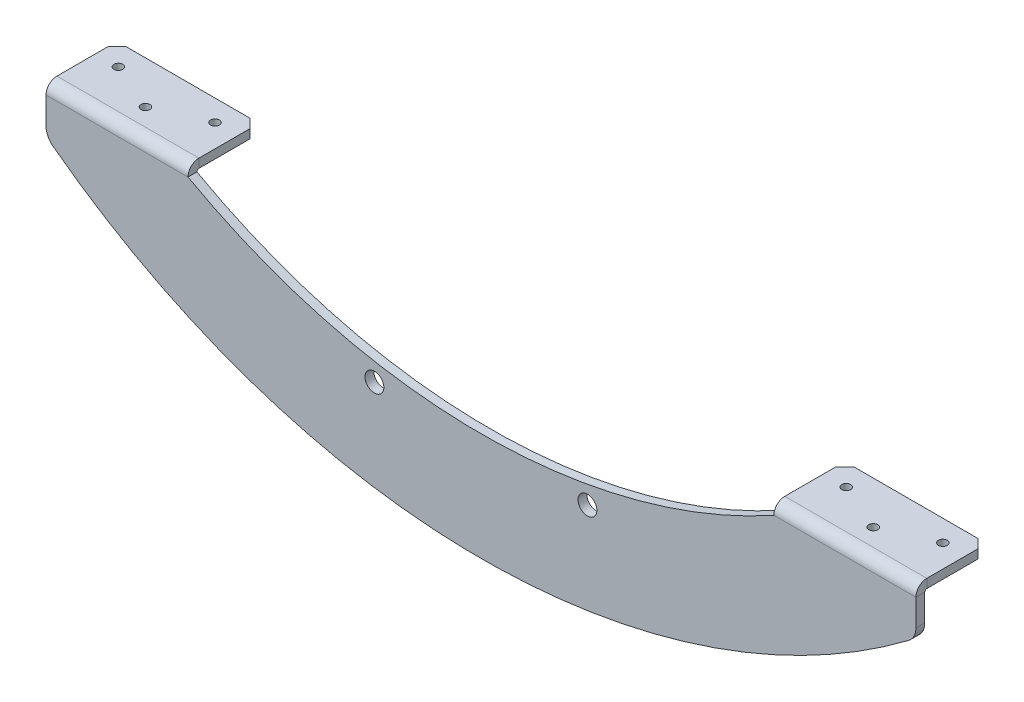
ISO-10303-21;
HEADER;
FILE_DESCRIPTION(('STEP AP214'),'2;1');
FILE_NAME('part.step','',(''),(''),'','','');
FILE_SCHEMA(('AUTOMOTIVE_DESIGN { 1 0 10303 214 1 1 1 1 }'));
ENDSEC;
DATA;
#1=APPLICATION_CONTEXT('core data for automotive mechanical design processes');
#2=APPLICATION_PROTOCOL_DEFINITION('international standard','automotive_design',2000,#1);
#3=PRODUCT_CONTEXT('',#1,'mechanical');
#4=PRODUCT('Part','Part','',(#3));
#5=PRODUCT_RELATED_PRODUCT_CATEGORY('part','',(#4));
#6=PRODUCT_DEFINITION_FORMATION('','',#4);
#7=PRODUCT_DEFINITION_CONTEXT('part definition',#1,'design');
#8=PRODUCT_DEFINITION('design','',#6,#7);
#9=PRODUCT_DEFINITION_SHAPE('','',#8);
#10=(LENGTH_UNIT() NAMED_UNIT(*) SI_UNIT(.MILLI.,.METRE.));
#11=(NAMED_UNIT(*) PLANE_ANGLE_UNIT() SI_UNIT($,.RADIAN.));
#12=(NAMED_UNIT(*) SI_UNIT($,.STERADIAN.) SOLID_ANGLE_UNIT());
#13=UNCERTAINTY_MEASURE_WITH_UNIT(LENGTH_MEASURE(1.E-05),#10,'distance_accuracy_value','');
#14=(GEOMETRIC_REPRESENTATION_CONTEXT(3) GLOBAL_UNCERTAINTY_ASSIGNED_CONTEXT((#13)) GLOBAL_UNIT_ASSIGNED_CONTEXT((#10,
#11,#12)) REPRESENTATION_CONTEXT('',''));
#15=CARTESIAN_POINT('',(0.,0.,0.));
#16=DIRECTION('',(0.,0.,1.));
#17=DIRECTION('',(1.,0.,0.));
#18=AXIS2_PLACEMENT_3D('',#15,#16,#17);
#19=CARTESIAN_POINT('',(0.,0.,-3.175));
#20=DIRECTION('',(-1.,0.,0.));
#21=DIRECTION('',(0.,0.,1.));
#22=AXIS2_PLACEMENT_3D('',#19,#20,#21);
#23=PLANE('',#22);
#24=DIRECTION('',(0.,-1.,0.));
#25=VECTOR('',#24,1.);
#26=CARTESIAN_POINT('',(0.,0.,0.));
#27=LINE('',#26,#25);
#28=CARTESIAN_POINT('',(0.,0.,0.));
#29=VERTEX_POINT('',#28);
#30=CARTESIAN_POINT('',(0.,-9.55604060288979,0.));
#31=VERTEX_POINT('',#30);
#32=EDGE_CURVE('E303',#29,#31,#27,.T.);
#33=ORIENTED_EDGE('',*,*,#32,.F.);
#34=DIRECTION('',(0.,0.,1.));
#35=VECTOR('',#34,1.);
#36=CARTESIAN_POINT('',(0.,0.,-3.175));
#37=LINE('',#36,#35);
#38=CARTESIAN_POINT('',(0.,0.,-3.175));
#39=VERTEX_POINT('',#38);
#40=EDGE_CURVE('E356',#39,#29,#37,.T.);
#41=ORIENTED_EDGE('',*,*,#40,.F.);
#42=DIRECTION('',(0.,-1.,0.));
#43=VECTOR('',#42,1.);
#44=CARTESIAN_POINT('',(0.,0.,-3.175));
#45=LINE('',#44,#43);
#46=CARTESIAN_POINT('',(0.,-9.55604060288979,-3.175));
#47=VERTEX_POINT('',#46);
#48=EDGE_CURVE('E312',#39,#47,#45,.T.);
#49=ORIENTED_EDGE('',*,*,#48,.T.);
#50=DIRECTION('',(0.,0.,1.));
#51=VECTOR('',#50,1.);
#52=CARTESIAN_POINT('',(0.,-9.55604060288979,-3.175));
#53=LINE('',#52,#51);
#54=EDGE_CURVE('E335',#47,#31,#53,.T.);
#55=ORIENTED_EDGE('',*,*,#54,.T.);
#56=EDGE_LOOP('',(#33,#41,#49,#55));
#57=FACE_BOUND('',#56,.T.);
#58=ADVANCED_FACE('F78',(#57),#23,.T.);
#59=CARTESIAN_POINT('',(155.575,188.772374501673,-3.175));
#60=DIRECTION('',(0.,0.,1.));
#61=DIRECTION('',(1.,0.,0.));
#62=AXIS2_PLACEMENT_3D('',#59,#60,#61);
#63=CYLINDRICAL_SURFACE('',#62,215.9);
#64=CARTESIAN_POINT('',(155.575,188.772374501673,0.));
#65=DIRECTION('',(0.,0.,-1.));
#66=DIRECTION('',(1.,0.,0.));
#67=AXIS2_PLACEMENT_3D('',#64,#65,#66);
#68=CIRCLE('',#67,215.9);
#69=CARTESIAN_POINT('',(260.35,0.,0.));
#70=VERTEX_POINT('',#69);
#71=CARTESIAN_POINT('',(50.8,0.,0.));
#72=VERTEX_POINT('',#71);
#73=EDGE_CURVE('E351',#70,#72,#68,.T.);
#74=ORIENTED_EDGE('',*,*,#73,.F.);
#75=DIRECTION('',(0.,0.,1.));
#76=VECTOR('',#75,1.);
#77=CARTESIAN_POINT('',(260.35,0.,-3.175));
#78=LINE('',#77,#76);
#79=CARTESIAN_POINT('',(260.35,0.,-3.175));
#80=VERTEX_POINT('',#79);
#81=EDGE_CURVE('E363',#80,#70,#78,.T.);
#82=ORIENTED_EDGE('',*,*,#81,.F.);
#83=CARTESIAN_POINT('',(155.575,188.772374501673,-3.175));
#84=DIRECTION('',(0.,0.,-1.));
#85=DIRECTION('',(1.,0.,0.));
#86=AXIS2_PLACEMENT_3D('',#83,#84,#85);
#87=CIRCLE('',#86,215.9);
#88=CARTESIAN_POINT('',(50.8,0.,-3.175));
#89=VERTEX_POINT('',#88);
#90=EDGE_CURVE('E330',#80,#89,#87,.T.);
#91=ORIENTED_EDGE('',*,*,#90,.T.);
#92=DIRECTION('',(0.,0.,1.));
#93=VECTOR('',#92,1.);
#94=CARTESIAN_POINT('',(50.8,0.,-3.175));
#95=LINE('',#94,#93);
#96=EDGE_CURVE('E360',#89,#72,#95,.T.);
#97=ORIENTED_EDGE('',*,*,#96,.T.);
#98=EDGE_LOOP('',(#74,#82,#91,#97));
#99=FACE_BOUND('',#98,.T.);
#100=ADVANCED_FACE('F470',(#99),#63,.F.);
#101=CARTESIAN_POINT('',(311.15,0.,-3.175));
#102=DIRECTION('',(1.,0.,0.));
#103=DIRECTION('',(0.,0.,-1.));
#104=AXIS2_PLACEMENT_3D('',#101,#102,#103);
#105=PLANE('',#104);
#106=DIRECTION('',(0.,1.,0.));
#107=VECTOR('',#106,1.);
#108=CARTESIAN_POINT('',(311.15,0.,0.));
#109=LINE('',#108,#107);
#110=CARTESIAN_POINT('',(311.15,-9.55604060288976,0.));
#111=VERTEX_POINT('',#110);
#112=CARTESIAN_POINT('',(311.15,0.,0.));
#113=VERTEX_POINT('',#112);
#114=EDGE_CURVE('E347',#111,#113,#109,.T.);
#115=ORIENTED_EDGE('',*,*,#114,.F.);
#116=DIRECTION('',(0.,0.,1.));
#117=VECTOR('',#116,1.);
#118=CARTESIAN_POINT('',(311.15,-9.55604060288976,-3.175));
#119=LINE('',#118,#117);
#120=CARTESIAN_POINT('',(311.15,-9.55604060288976,-3.175));
#121=VERTEX_POINT('',#120);
#122=EDGE_CURVE('E368',#121,#111,#119,.T.);
#123=ORIENTED_EDGE('',*,*,#122,.F.);
#124=DIRECTION('',(0.,1.,0.));
#125=VECTOR('',#124,1.);
#126=CARTESIAN_POINT('',(311.15,0.,-3.175));
#127=LINE('',#126,#125);
#128=CARTESIAN_POINT('',(311.15,0.,-3.175));
#129=VERTEX_POINT('',#128);
#130=EDGE_CURVE('E325',#121,#129,#127,.T.);
#131=ORIENTED_EDGE('',*,*,#130,.T.);
#132=DIRECTION('',(0.,0.,1.));
#133=VECTOR('',#132,1.);
#134=CARTESIAN_POINT('',(311.15,0.,-3.175));
#135=LINE('',#134,#133);
#136=EDGE_CURVE('E366',#129,#113,#135,.T.);
#137=ORIENTED_EDGE('',*,*,#136,.T.);
#138=EDGE_LOOP('',(#115,#123,#131,#137));
#139=FACE_BOUND('',#138,.T.);
#140=ADVANCED_FACE('F476',(#139),#105,.T.);
#141=CARTESIAN_POINT('',(304.8,-9.55604060288976,-3.175));
#142=DIRECTION('',(0.,0.,1.));
#143=DIRECTION('',(1.,0.,0.));
#144=AXIS2_PLACEMENT_3D('',#141,#142,#143);
#145=CYLINDRICAL_SURFACE('',#144,6.35000000000001);
#146=CARTESIAN_POINT('',(304.8,-9.55604060288976,0.));
#147=DIRECTION('',(0.,0.,1.));
#148=DIRECTION('',(1.,0.,0.));
#149=AXIS2_PLACEMENT_3D('',#146,#147,#148);
#150=CIRCLE('',#149,6.35000000000001);
#151=CARTESIAN_POINT('',(308.617833523832,-14.6301560119344,0.));
#152=VERTEX_POINT('',#151);
#153=EDGE_CURVE('E344',#152,#111,#150,.T.);
#154=ORIENTED_EDGE('',*,*,#153,.F.);
#155=DIRECTION('',(0.,0.,1.));
#156=VECTOR('',#155,1.);
#157=CARTESIAN_POINT('',(308.617833523832,-14.6301560119344,-3.175));
#158=LINE('',#157,#156);
#159=CARTESIAN_POINT('',(308.617833523832,-14.6301560119344,-3.175));
#160=VERTEX_POINT('',#159);
#161=EDGE_CURVE('E370',#160,#152,#158,.T.);
#162=ORIENTED_EDGE('',*,*,#161,.F.);
#163=CARTESIAN_POINT('',(304.8,-9.55604060288976,-3.175));
#164=DIRECTION('',(0.,0.,1.));
#165=DIRECTION('',(1.,0.,0.));
#166=AXIS2_PLACEMENT_3D('',#163,#164,#165);
#167=CIRCLE('',#166,6.35000000000001);
#168=EDGE_CURVE('E322',#160,#121,#167,.T.);
#169=ORIENTED_EDGE('',*,*,#168,.T.);
#170=ORIENTED_EDGE('',*,*,#122,.T.);
#171=EDGE_LOOP('',(#154,#162,#169,#170));
#172=FACE_BOUND('',#171,.T.);
#173=ADVANCED_FACE('F595',(#172),#145,.T.);
#174=CARTESIAN_POINT('',(155.575,188.772374501673,-3.175));
#175=DIRECTION('',(0.,0.,1.));
#176=DIRECTION('',(1.,0.,0.));
#177=AXIS2_PLACEMENT_3D('',#174,#175,#176);
#178=CYLINDRICAL_SURFACE('',#177,254.54802751611);
#179=CARTESIAN_POINT('',(155.575,188.772374501673,0.));
#180=DIRECTION('',(0.,0.,1.));
#181=DIRECTION('',(1.,0.,0.));
#182=AXIS2_PLACEMENT_3D('',#179,#180,#181);
#183=CIRCLE('',#182,254.54802751611);
#184=CARTESIAN_POINT('',(2.53216647616783,-14.6301560119343,0.));
#185=VERTEX_POINT('',#184);
#186=EDGE_CURVE('E341',#185,#152,#183,.T.);
#187=ORIENTED_EDGE('',*,*,#186,.F.);
#188=DIRECTION('',(0.,0.,1.));
#189=VECTOR('',#188,1.);
#190=CARTESIAN_POINT('',(2.53216647616783,-14.6301560119343,-3.175));
#191=LINE('',#190,#189);
#192=CARTESIAN_POINT('',(2.53216647616783,-14.6301560119343,-3.175));
#193=VERTEX_POINT('',#192);
#194=EDGE_CURVE('E372',#193,#185,#191,.T.);
#195=ORIENTED_EDGE('',*,*,#194,.F.);
#196=CARTESIAN_POINT('',(155.575,188.772374501673,-3.175));
#197=DIRECTION('',(0.,0.,1.));
#198=DIRECTION('',(1.,0.,0.));
#199=AXIS2_PLACEMENT_3D('',#196,#197,#198);
#200=CIRCLE('',#199,254.54802751611);
#201=EDGE_CURVE('E319',#193,#160,#200,.T.);
#202=ORIENTED_EDGE('',*,*,#201,.T.);
#203=ORIENTED_EDGE('',*,*,#161,.T.);
#204=EDGE_LOOP('',(#187,#195,#202,#203));
#205=FACE_BOUND('',#204,.T.);
#206=ADVANCED_FACE('F598',(#205),#178,.T.);
#207=CARTESIAN_POINT('',(6.35,-9.55604060288979,-3.175));
#208=DIRECTION('',(0.,0.,1.));
#209=DIRECTION('',(1.,0.,0.));
#210=AXIS2_PLACEMENT_3D('',#207,#208,#209);
#211=CYLINDRICAL_SURFACE('',#210,6.35);
#212=CARTESIAN_POINT('',(6.35,-9.55604060288979,0.));
#213=DIRECTION('',(0.,0.,1.));
#214=DIRECTION('',(1.,0.,0.));
#215=AXIS2_PLACEMENT_3D('',#212,#213,#214);
#216=CIRCLE('',#215,6.35);
#217=EDGE_CURVE('E338',#31,#185,#216,.T.);
#218=ORIENTED_EDGE('',*,*,#217,.F.);
#219=ORIENTED_EDGE('',*,*,#54,.F.);
#220=CARTESIAN_POINT('',(6.35,-9.55604060288979,-3.175));
#221=DIRECTION('',(0.,0.,1.));
#222=DIRECTION('',(1.,0.,0.));
#223=AXIS2_PLACEMENT_3D('',#220,#221,#222);
#224=CIRCLE('',#223,6.35);
#225=EDGE_CURVE('E315',#47,#193,#224,.T.);
#226=ORIENTED_EDGE('',*,*,#225,.T.);
#227=ORIENTED_EDGE('',*,*,#194,.T.);
#228=EDGE_LOOP('',(#218,#219,#226,#227));
#229=FACE_BOUND('',#228,.T.);
#230=ADVANCED_FACE('F481',(#229),#211,.T.);
#231=CARTESIAN_POINT('',(6.35,-9.55604060288979,-3.175));
#232=DIRECTION('',(0.,0.,1.));
#233=DIRECTION('',(1.,0.,0.));
#234=AXIS2_PLACEMENT_3D('',#231,#232,#233);
#235=PLANE('',#234);
#236=CARTESIAN_POINT('',(117.475,-30.1875590478233,-3.175));
#237=DIRECTION('',(0.,0.,1.));
#238=DIRECTION('',(1.,0.,0.));
#239=AXIS2_PLACEMENT_3D('',#236,#237,#238);
#240=CIRCLE('',#239,3.37819999999999);
#241=CARTESIAN_POINT('',(120.8532,-30.1875590478233,-3.175));
#242=VERTEX_POINT('',#241);
#243=EDGE_CURVE('E269',#242,#242,#240,.T.);
#244=ORIENTED_EDGE('',*,*,#243,.T.);
#245=EDGE_LOOP('',(#244));
#246=FACE_BOUND('',#245,.T.);
#247=CARTESIAN_POINT('',(193.675,-30.1875590478233,-3.175));
#248=DIRECTION('',(0.,0.,1.));
#249=DIRECTION('',(1.,0.,0.));
#250=AXIS2_PLACEMENT_3D('',#247,#248,#249);
#251=CIRCLE('',#250,3.37819999999999);
#252=CARTESIAN_POINT('',(197.0532,-30.1875590478233,-3.175));
#253=VERTEX_POINT('',#252);
#254=EDGE_CURVE('E441',#253,#253,#251,.T.);
#255=ORIENTED_EDGE('',*,*,#254,.T.);
#256=EDGE_LOOP('',(#255));
#257=FACE_BOUND('',#256,.T.);
#258=ORIENTED_EDGE('',*,*,#48,.F.);
#259=DIRECTION('',(-1.,0.,0.));
#260=VECTOR('',#259,1.);
#261=CARTESIAN_POINT('',(0.,0.,-3.175));
#262=LINE('',#261,#260);
#263=EDGE_CURVE('E333',#89,#39,#262,.T.);
#264=ORIENTED_EDGE('',*,*,#263,.F.);
#265=ORIENTED_EDGE('',*,*,#90,.F.);
#266=DIRECTION('',(-1.,0.,0.));
#267=VECTOR('',#266,1.);
#268=CARTESIAN_POINT('',(260.35,0.,-3.175));
#269=LINE('',#268,#267);
#270=EDGE_CURVE('E328',#129,#80,#269,.T.);
#271=ORIENTED_EDGE('',*,*,#270,.F.);
#272=ORIENTED_EDGE('',*,*,#130,.F.);
#273=ORIENTED_EDGE('',*,*,#168,.F.);
#274=ORIENTED_EDGE('',*,*,#201,.F.);
#275=ORIENTED_EDGE('',*,*,#225,.F.);
#276=EDGE_LOOP('',(#258,#264,#265,#271,#272,#273,#274,#275));
#277=FACE_BOUND('',#276,.T.);
#278=ADVANCED_FACE('F449',(#246,#257,#277),#235,.F.);
#279=CARTESIAN_POINT('',(6.35,-9.55604060288979,0.));
#280=DIRECTION('',(0.,0.,1.));
#281=DIRECTION('',(1.,0.,0.));
#282=AXIS2_PLACEMENT_3D('',#279,#280,#281);
#283=PLANE('',#282);
#284=CARTESIAN_POINT('',(117.475,-30.1875590478233,0.));
#285=DIRECTION('',(0.,0.,1.));
#286=DIRECTION('',(1.,0.,0.));
#287=AXIS2_PLACEMENT_3D('',#284,#285,#286);
#288=CIRCLE('',#287,3.37819999999999);
#289=CARTESIAN_POINT('',(120.8532,-30.1875590478233,0.));
#290=VERTEX_POINT('',#289);
#291=EDGE_CURVE('E438',#290,#290,#288,.T.);
#292=ORIENTED_EDGE('',*,*,#291,.F.);
#293=EDGE_LOOP('',(#292));
#294=FACE_BOUND('',#293,.T.);
#295=CARTESIAN_POINT('',(193.675,-30.1875590478233,0.));
#296=DIRECTION('',(0.,0.,1.));
#297=DIRECTION('',(1.,0.,0.));
#298=AXIS2_PLACEMENT_3D('',#295,#296,#297);
#299=CIRCLE('',#298,3.37819999999999);
#300=CARTESIAN_POINT('',(197.0532,-30.1875590478233,0.));
#301=VERTEX_POINT('',#300);
#302=EDGE_CURVE('E417',#301,#301,#299,.T.);
#303=ORIENTED_EDGE('',*,*,#302,.F.);
#304=EDGE_LOOP('',(#303));
#305=FACE_BOUND('',#304,.T.);
#306=ORIENTED_EDGE('',*,*,#32,.T.);
#307=ORIENTED_EDGE('',*,*,#217,.T.);
#308=ORIENTED_EDGE('',*,*,#186,.T.);
#309=ORIENTED_EDGE('',*,*,#153,.T.);
#310=ORIENTED_EDGE('',*,*,#114,.T.);
#311=DIRECTION('',(-1.,0.,0.));
#312=VECTOR('',#311,1.);
#313=CARTESIAN_POINT('',(260.35,0.,0.));
#314=LINE('',#313,#312);
#315=EDGE_CURVE('E225',#113,#70,#314,.T.);
#316=ORIENTED_EDGE('',*,*,#315,.T.);
#317=ORIENTED_EDGE('',*,*,#73,.T.);
#318=DIRECTION('',(-1.,0.,0.));
#319=VECTOR('',#318,1.);
#320=CARTESIAN_POINT('',(0.,0.,0.));
#321=LINE('',#320,#319);
#322=EDGE_CURVE('E316',#72,#29,#321,.T.);
#323=ORIENTED_EDGE('',*,*,#322,.T.);
#324=EDGE_LOOP('',(#306,#307,#308,#309,#310,#316,#317,#323));
#325=FACE_BOUND('',#324,.T.);
#326=ADVANCED_FACE('F533',(#294,#305,#325),#283,.T.);
#327=CARTESIAN_POINT('',(0.,0.,-3.9116));
#328=DIRECTION('',(-1.,0.,0.));
#329=DIRECTION('',(0.,-1.,0.));
#330=AXIS2_PLACEMENT_3D('',#327,#328,#329);
#331=PLANE('',#330);
#332=DIRECTION('',(0.,-1.,0.));
#333=VECTOR('',#332,1.);
#334=CARTESIAN_POINT('',(0.,3.9116,-3.91159999999999));
#335=LINE('',#334,#333);
#336=CARTESIAN_POINT('',(0.,0.7366,-3.9116));
#337=VERTEX_POINT('',#336);
#338=CARTESIAN_POINT('',(0.,3.9116,-3.91159999999999));
#339=VERTEX_POINT('',#338);
#340=EDGE_CURVE('E270',#337,#339,#335,.F.);
#341=ORIENTED_EDGE('',*,*,#340,.F.);
#342=CARTESIAN_POINT('',(0.,0.,-3.9116));
#343=DIRECTION('',(1.,0.,0.));
#344=DIRECTION('',(0.,1.,0.));
#345=AXIS2_PLACEMENT_3D('',#342,#343,#344);
#346=CIRCLE('',#345,0.736600000000002);
#347=EDGE_CURVE('E307',#39,#337,#346,.F.);
#348=ORIENTED_EDGE('',*,*,#347,.F.);
#349=ORIENTED_EDGE('',*,*,#40,.T.);
#350=CARTESIAN_POINT('',(0.,0.,-3.9116));
#351=DIRECTION('',(1.,0.,0.));
#352=DIRECTION('',(0.,1.,0.));
#353=AXIS2_PLACEMENT_3D('',#350,#351,#352);
#354=CIRCLE('',#353,3.9116);
#355=EDGE_CURVE('E300',#29,#339,#354,.F.);
#356=ORIENTED_EDGE('',*,*,#355,.T.);
#357=EDGE_LOOP('',(#341,#348,#349,#356));
#358=FACE_BOUND('',#357,.T.);
#359=ADVANCED_FACE('F530',(#358),#331,.T.);
#360=CARTESIAN_POINT('',(50.8,0.,-3.9116));
#361=DIRECTION('',(-1.,0.,0.));
#362=DIRECTION('',(0.,-1.,0.));
#363=AXIS2_PLACEMENT_3D('',#360,#361,#362);
#364=PLANE('',#363);
#365=CARTESIAN_POINT('',(50.8,0.,-3.9116));
#366=DIRECTION('',(1.,0.,0.));
#367=DIRECTION('',(0.,1.,0.));
#368=AXIS2_PLACEMENT_3D('',#365,#366,#367);
#369=CIRCLE('',#368,0.736600000000002);
#370=CARTESIAN_POINT('',(50.8,0.736600000000004,-3.9116));
#371=VERTEX_POINT('',#370);
#372=EDGE_CURVE('E277',#371,#89,#369,.T.);
#373=ORIENTED_EDGE('',*,*,#372,.F.);
#374=DIRECTION('',(0.,-1.,0.));
#375=VECTOR('',#374,1.);
#376=CARTESIAN_POINT('',(50.8,0.7366,-3.9116));
#377=LINE('',#376,#375);
#378=CARTESIAN_POINT('',(50.8,3.9116,-3.91159999999999));
#379=VERTEX_POINT('',#378);
#380=EDGE_CURVE('E293',#371,#379,#377,.F.);
#381=ORIENTED_EDGE('',*,*,#380,.T.);
#382=CARTESIAN_POINT('',(50.8,0.,-3.9116));
#383=DIRECTION('',(1.,0.,0.));
#384=DIRECTION('',(0.,1.,0.));
#385=AXIS2_PLACEMENT_3D('',#382,#383,#384);
#386=CIRCLE('',#385,3.9116);
#387=EDGE_CURVE('E304',#379,#72,#386,.T.);
#388=ORIENTED_EDGE('',*,*,#387,.T.);
#389=ORIENTED_EDGE('',*,*,#96,.F.);
#390=EDGE_LOOP('',(#373,#381,#388,#389));
#391=FACE_BOUND('',#390,.T.);
#392=ADVANCED_FACE('F537',(#391),#364,.F.);
#393=CARTESIAN_POINT('',(50.8,0.,-3.9116));
#394=DIRECTION('',(1.,0.,0.));
#395=DIRECTION('',(0.,1.,0.));
#396=AXIS2_PLACEMENT_3D('',#393,#394,#395);
#397=CYLINDRICAL_SURFACE('',#396,3.9116);
#398=ORIENTED_EDGE('',*,*,#322,.F.);
#399=ORIENTED_EDGE('',*,*,#387,.F.);
#400=DIRECTION('',(1.,0.,0.));
#401=VECTOR('',#400,1.);
#402=CARTESIAN_POINT('',(0.,3.9116,-3.91159999999999));
#403=LINE('',#402,#401);
#404=EDGE_CURVE('E290',#379,#339,#403,.F.);
#405=ORIENTED_EDGE('',*,*,#404,.T.);
#406=ORIENTED_EDGE('',*,*,#355,.F.);
#407=EDGE_LOOP('',(#398,#399,#405,#406));
#408=FACE_BOUND('',#407,.T.);
#409=ADVANCED_FACE('F535',(#408),#397,.T.);
#410=CARTESIAN_POINT('',(50.8,0.,-3.9116));
#411=DIRECTION('',(1.,0.,0.));
#412=DIRECTION('',(0.,1.,0.));
#413=AXIS2_PLACEMENT_3D('',#410,#411,#412);
#414=CYLINDRICAL_SURFACE('',#413,0.736600000000002);
#415=ORIENTED_EDGE('',*,*,#263,.T.);
#416=ORIENTED_EDGE('',*,*,#347,.T.);
#417=DIRECTION('',(1.,0.,0.));
#418=VECTOR('',#417,1.);
#419=CARTESIAN_POINT('',(0.,0.7366,-3.9116));
#420=LINE('',#419,#418);
#421=EDGE_CURVE('E296',#337,#371,#420,.T.);
#422=ORIENTED_EDGE('',*,*,#421,.T.);
#423=ORIENTED_EDGE('',*,*,#372,.T.);
#424=EDGE_LOOP('',(#415,#416,#422,#423));
#425=FACE_BOUND('',#424,.T.);
#426=ADVANCED_FACE('F524',(#425),#414,.F.);
#427=CARTESIAN_POINT('',(50.8,3.91160000000008,-25.4));
#428=DIRECTION('',(-1.,0.,0.));
#429=DIRECTION('',(0.,0.,1.));
#430=AXIS2_PLACEMENT_3D('',#427,#428,#429);
#431=PLANE('',#430);
#432=DIRECTION('',(0.,0.,1.));
#433=VECTOR('',#432,1.);
#434=CARTESIAN_POINT('',(50.8,0.736600000000075,-25.4));
#435=LINE('',#434,#433);
#436=CARTESIAN_POINT('',(50.8,0.736600000000064,-22.225));
#437=VERTEX_POINT('',#436);
#438=EDGE_CURVE('E287',#371,#437,#435,.F.);
#439=ORIENTED_EDGE('',*,*,#438,.T.);
#440=DIRECTION('',(0.,1.,0.));
#441=VECTOR('',#440,1.);
#442=CARTESIAN_POINT('',(50.8,3.91160000000006,-22.225));
#443=LINE('',#442,#441);
#444=CARTESIAN_POINT('',(50.8,3.91160000000006,-22.225));
#445=VERTEX_POINT('',#444);
#446=EDGE_CURVE('E390',#437,#445,#443,.T.);
#447=ORIENTED_EDGE('',*,*,#446,.T.);
#448=DIRECTION('',(0.,0.,-1.));
#449=VECTOR('',#448,1.);
#450=CARTESIAN_POINT('',(50.8,3.91159999999999,0.));
#451=LINE('',#450,#449);
#452=EDGE_CURVE('E280',#379,#445,#451,.T.);
#453=ORIENTED_EDGE('',*,*,#452,.F.);
#454=ORIENTED_EDGE('',*,*,#380,.F.);
#455=EDGE_LOOP('',(#439,#447,#453,#454));
#456=FACE_BOUND('',#455,.T.);
#457=ADVANCED_FACE('F547',(#456),#431,.F.);
#458=CARTESIAN_POINT('',(0.,3.9116,-3.17499999999999));
#459=DIRECTION('',(1.,0.,0.));
#460=DIRECTION('',(0.,0.,-1.));
#461=AXIS2_PLACEMENT_3D('',#458,#459,#460);
#462=PLANE('',#461);
#463=DIRECTION('',(0.,0.,1.));
#464=VECTOR('',#463,1.);
#465=CARTESIAN_POINT('',(0.,3.91159999999999,0.));
#466=LINE('',#465,#464);
#467=CARTESIAN_POINT('',(0.,3.91160000000006,-22.225));
#468=VERTEX_POINT('',#467);
#469=EDGE_CURVE('E275',#468,#339,#466,.T.);
#470=ORIENTED_EDGE('',*,*,#469,.F.);
#471=DIRECTION('',(0.,-1.,0.));
#472=VECTOR('',#471,1.);
#473=CARTESIAN_POINT('',(0.,3.91160000000006,-22.225));
#474=LINE('',#473,#472);
#475=CARTESIAN_POINT('',(0.,0.736600000000064,-22.225));
#476=VERTEX_POINT('',#475);
#477=EDGE_CURVE('E359',#468,#476,#474,.T.);
#478=ORIENTED_EDGE('',*,*,#477,.T.);
#479=DIRECTION('',(0.,0.,-1.));
#480=VECTOR('',#479,1.);
#481=CARTESIAN_POINT('',(0.,0.736599999999998,-3.175));
#482=LINE('',#481,#480);
#483=EDGE_CURVE('E283',#476,#337,#482,.F.);
#484=ORIENTED_EDGE('',*,*,#483,.T.);
#485=ORIENTED_EDGE('',*,*,#340,.T.);
#486=EDGE_LOOP('',(#470,#478,#484,#485));
#487=FACE_BOUND('',#486,.T.);
#488=ADVANCED_FACE('F558',(#487),#462,.F.);
#489=CARTESIAN_POINT('',(0.,3.91159999999999,0.));
#490=DIRECTION('',(0.,-1.,0.));
#491=DIRECTION('',(0.,0.,-1.));
#492=AXIS2_PLACEMENT_3D('',#489,#490,#491);
#493=PLANE('',#492);
#494=CARTESIAN_POINT('',(8.128,3.91160000000005,-17.78));
#495=DIRECTION('',(0.,1.,0.));
#496=DIRECTION('',(0.,0.,1.));
#497=AXIS2_PLACEMENT_3D('',#494,#495,#496);
#498=CIRCLE('',#497,1.5875);
#499=CARTESIAN_POINT('',(8.128,3.91160000000004,-16.1925));
#500=VERTEX_POINT('',#499);
#501=EDGE_CURVE('E411',#500,#500,#498,.T.);
#502=ORIENTED_EDGE('',*,*,#501,.F.);
#503=EDGE_LOOP('',(#502));
#504=FACE_BOUND('',#503,.T.);
#505=CARTESIAN_POINT('',(25.4,3.91160000000002,-10.16));
#506=DIRECTION('',(0.,1.,0.));
#507=DIRECTION('',(0.,0.,1.));
#508=AXIS2_PLACEMENT_3D('',#505,#506,#507);
#509=CIRCLE('',#508,1.5875);
#510=CARTESIAN_POINT('',(25.4,3.91160000000002,-8.5725));
#511=VERTEX_POINT('',#510);
#512=EDGE_CURVE('E430',#511,#511,#509,.T.);
#513=ORIENTED_EDGE('',*,*,#512,.F.);
#514=EDGE_LOOP('',(#513));
#515=FACE_BOUND('',#514,.T.);
#516=CARTESIAN_POINT('',(42.672,3.91160000000005,-17.78));
#517=DIRECTION('',(0.,1.,0.));
#518=DIRECTION('',(0.,0.,1.));
#519=AXIS2_PLACEMENT_3D('',#516,#517,#518);
#520=CIRCLE('',#519,1.5875);
#521=CARTESIAN_POINT('',(42.672,3.91160000000004,-16.1925));
#522=VERTEX_POINT('',#521);
#523=EDGE_CURVE('E426',#522,#522,#520,.T.);
#524=ORIENTED_EDGE('',*,*,#523,.F.);
#525=EDGE_LOOP('',(#524));
#526=FACE_BOUND('',#525,.T.);
#527=ORIENTED_EDGE('',*,*,#452,.T.);
#528=DIRECTION('',(0.707106781186548,0.,0.707106781186547));
#529=VECTOR('',#528,1.);
#530=CARTESIAN_POINT('',(47.625,3.91160000000008,-25.4));
#531=LINE('',#530,#529);
#532=CARTESIAN_POINT('',(47.625,3.91160000000007,-25.4));
#533=VERTEX_POINT('',#532);
#534=EDGE_CURVE('E392',#445,#533,#531,.F.);
#535=ORIENTED_EDGE('',*,*,#534,.T.);
#536=DIRECTION('',(-1.,0.,0.));
#537=VECTOR('',#536,1.);
#538=CARTESIAN_POINT('',(0.,3.91160000000007,-25.4));
#539=LINE('',#538,#537);
#540=CARTESIAN_POINT('',(3.17500000000002,3.91160000000007,-25.4));
#541=VERTEX_POINT('',#540);
#542=EDGE_CURVE('E278',#533,#541,#539,.T.);
#543=ORIENTED_EDGE('',*,*,#542,.T.);
#544=DIRECTION('',(0.707106781186548,0.,-0.707106781186547));
#545=VECTOR('',#544,1.);
#546=CARTESIAN_POINT('',(0.,3.91160000000006,-22.225));
#547=LINE('',#546,#545);
#548=EDGE_CURVE('E383',#541,#468,#547,.F.);
#549=ORIENTED_EDGE('',*,*,#548,.T.);
#550=ORIENTED_EDGE('',*,*,#469,.T.);
#551=ORIENTED_EDGE('',*,*,#404,.F.);
#552=EDGE_LOOP('',(#527,#535,#543,#549,#550,#551));
#553=FACE_BOUND('',#552,.T.);
#554=ADVANCED_FACE('F544',(#504,#515,#526,#553),#493,.F.);
#555=CARTESIAN_POINT('',(0.,0.736599999999986,0.));
#556=DIRECTION('',(0.,-1.,0.));
#557=DIRECTION('',(0.,0.,-1.));
#558=AXIS2_PLACEMENT_3D('',#555,#556,#557);
#559=PLANE('',#558);
#560=CARTESIAN_POINT('',(8.128,0.736600000000046,-17.78));
#561=DIRECTION('',(0.,-1.,0.));
#562=DIRECTION('',(0.,0.,-1.));
#563=AXIS2_PLACEMENT_3D('',#560,#561,#562);
#564=CIRCLE('',#563,1.5875);
#565=CARTESIAN_POINT('',(8.128,0.736600000000051,-19.3675));
#566=VERTEX_POINT('',#565);
#567=EDGE_CURVE('E414',#566,#566,#564,.T.);
#568=ORIENTED_EDGE('',*,*,#567,.F.);
#569=EDGE_LOOP('',(#568));
#570=FACE_BOUND('',#569,.T.);
#571=CARTESIAN_POINT('',(25.4,0.736600000000032,-10.16));
#572=DIRECTION('',(0.,-1.,0.));
#573=DIRECTION('',(0.,0.,-1.));
#574=AXIS2_PLACEMENT_3D('',#571,#572,#573);
#575=CIRCLE('',#574,1.5875);
#576=CARTESIAN_POINT('',(25.4,0.736600000000037,-11.7475));
#577=VERTEX_POINT('',#576);
#578=EDGE_CURVE('E410',#577,#577,#575,.T.);
#579=ORIENTED_EDGE('',*,*,#578,.F.);
#580=EDGE_LOOP('',(#579));
#581=FACE_BOUND('',#580,.T.);
#582=CARTESIAN_POINT('',(42.672,0.736600000000046,-17.78));
#583=DIRECTION('',(0.,-1.,0.));
#584=DIRECTION('',(0.,0.,-1.));
#585=AXIS2_PLACEMENT_3D('',#582,#583,#584);
#586=CIRCLE('',#585,1.5875);
#587=CARTESIAN_POINT('',(42.672,0.736600000000051,-19.3675));
#588=VERTEX_POINT('',#587);
#589=EDGE_CURVE('E407',#588,#588,#586,.T.);
#590=ORIENTED_EDGE('',*,*,#589,.F.);
#591=EDGE_LOOP('',(#590));
#592=FACE_BOUND('',#591,.T.);
#593=DIRECTION('',(1.,0.,0.));
#594=VECTOR('',#593,1.);
#595=CARTESIAN_POINT('',(0.,0.736600000000075,-25.4));
#596=LINE('',#595,#594);
#597=CARTESIAN_POINT('',(47.625,0.736600000000075,-25.4));
#598=VERTEX_POINT('',#597);
#599=CARTESIAN_POINT('',(3.17500000000002,0.736600000000075,-25.4));
#600=VERTEX_POINT('',#599);
#601=EDGE_CURVE('E285',#598,#600,#596,.F.);
#602=ORIENTED_EDGE('',*,*,#601,.F.);
#603=DIRECTION('',(-0.707106781186548,0.,-0.707106781186547));
#604=VECTOR('',#603,1.);
#605=CARTESIAN_POINT('',(36.5125,0.736600000000114,-36.5125));
#606=LINE('',#605,#604);
#607=EDGE_CURVE('E388',#598,#437,#606,.F.);
#608=ORIENTED_EDGE('',*,*,#607,.T.);
#609=ORIENTED_EDGE('',*,*,#438,.F.);
#610=ORIENTED_EDGE('',*,*,#421,.F.);
#611=ORIENTED_EDGE('',*,*,#483,.F.);
#612=DIRECTION('',(-0.707106781186548,0.,0.707106781186547));
#613=VECTOR('',#612,1.);
#614=CARTESIAN_POINT('',(-11.1125,0.736600000000025,-11.1125));
#615=LINE('',#614,#613);
#616=EDGE_CURVE('E377',#476,#600,#615,.F.);
#617=ORIENTED_EDGE('',*,*,#616,.T.);
#618=EDGE_LOOP('',(#602,#608,#609,#610,#611,#617));
#619=FACE_BOUND('',#618,.T.);
#620=ADVANCED_FACE('F561',(#570,#581,#592,#619),#559,.T.);
#621=CARTESIAN_POINT('',(0.,3.91160000000008,-25.4));
#622=DIRECTION('',(0.,0.,1.));
#623=DIRECTION('',(0.,-1.,0.));
#624=AXIS2_PLACEMENT_3D('',#621,#622,#623);
#625=PLANE('',#624);
#626=ORIENTED_EDGE('',*,*,#542,.F.);
#627=DIRECTION('',(0.,-1.,0.));
#628=VECTOR('',#627,1.);
#629=CARTESIAN_POINT('',(47.625,3.91160000000008,-25.4));
#630=LINE('',#629,#628);
#631=EDGE_CURVE('E385',#533,#598,#630,.T.);
#632=ORIENTED_EDGE('',*,*,#631,.T.);
#633=ORIENTED_EDGE('',*,*,#601,.T.);
#634=DIRECTION('',(0.,1.,0.));
#635=VECTOR('',#634,1.);
#636=CARTESIAN_POINT('',(3.17500000000002,3.91160000000008,-25.4));
#637=LINE('',#636,#635);
#638=EDGE_CURVE('E380',#600,#541,#637,.T.);
#639=ORIENTED_EDGE('',*,*,#638,.T.);
#640=EDGE_LOOP('',(#626,#632,#633,#639));
#641=FACE_BOUND('',#640,.T.);
#642=ADVANCED_FACE('F552',(#641),#625,.F.);
#643=CARTESIAN_POINT('',(260.35,0.,-3.9116));
#644=DIRECTION('',(-1.,0.,0.));
#645=DIRECTION('',(0.,-1.,0.));
#646=AXIS2_PLACEMENT_3D('',#643,#644,#645);
#647=PLANE('',#646);
#648=DIRECTION('',(0.,-1.,0.));
#649=VECTOR('',#648,1.);
#650=CARTESIAN_POINT('',(260.35,3.9116,-3.91159999999999));
#651=LINE('',#650,#649);
#652=CARTESIAN_POINT('',(260.35,0.7366,-3.9116));
#653=VERTEX_POINT('',#652);
#654=CARTESIAN_POINT('',(260.35,3.9116,-3.91159999999999));
#655=VERTEX_POINT('',#654);
#656=EDGE_CURVE('E266',#653,#655,#651,.F.);
#657=ORIENTED_EDGE('',*,*,#656,.F.);
#658=CARTESIAN_POINT('',(260.35,0.,-3.9116));
#659=DIRECTION('',(1.,0.,0.));
#660=DIRECTION('',(0.,1.,0.));
#661=AXIS2_PLACEMENT_3D('',#658,#659,#660);
#662=CIRCLE('',#661,0.736600000000002);
#663=EDGE_CURVE('E229',#80,#653,#662,.F.);
#664=ORIENTED_EDGE('',*,*,#663,.F.);
#665=ORIENTED_EDGE('',*,*,#81,.T.);
#666=CARTESIAN_POINT('',(260.35,0.,-3.9116));
#667=DIRECTION('',(1.,0.,0.));
#668=DIRECTION('',(0.,1.,0.));
#669=AXIS2_PLACEMENT_3D('',#666,#667,#668);
#670=CIRCLE('',#669,3.9116);
#671=EDGE_CURVE('E228',#70,#655,#670,.F.);
#672=ORIENTED_EDGE('',*,*,#671,.T.);
#673=EDGE_LOOP('',(#657,#664,#665,#672));
#674=FACE_BOUND('',#673,.T.);
#675=ADVANCED_FACE('F514',(#674),#647,.T.);
#676=CARTESIAN_POINT('',(311.15,0.,-3.9116));
#677=DIRECTION('',(-1.,0.,0.));
#678=DIRECTION('',(0.,-1.,0.));
#679=AXIS2_PLACEMENT_3D('',#676,#677,#678);
#680=PLANE('',#679);
#681=CARTESIAN_POINT('',(311.15,0.,-3.9116));
#682=DIRECTION('',(1.,0.,0.));
#683=DIRECTION('',(0.,1.,0.));
#684=AXIS2_PLACEMENT_3D('',#681,#682,#683);
#685=CIRCLE('',#684,0.736600000000002);
#686=CARTESIAN_POINT('',(311.15,0.736600000000004,-3.9116));
#687=VERTEX_POINT('',#686);
#688=EDGE_CURVE('E236',#687,#129,#685,.T.);
#689=ORIENTED_EDGE('',*,*,#688,.F.);
#690=DIRECTION('',(0.,-1.,0.));
#691=VECTOR('',#690,1.);
#692=CARTESIAN_POINT('',(311.15,0.7366,-3.9116));
#693=LINE('',#692,#691);
#694=CARTESIAN_POINT('',(311.15,3.9116,-3.91159999999999));
#695=VERTEX_POINT('',#694);
#696=EDGE_CURVE('E233',#687,#695,#693,.F.);
#697=ORIENTED_EDGE('',*,*,#696,.T.);
#698=CARTESIAN_POINT('',(311.15,0.,-3.9116));
#699=DIRECTION('',(1.,0.,0.));
#700=DIRECTION('',(0.,1.,0.));
#701=AXIS2_PLACEMENT_3D('',#698,#699,#700);
#702=CIRCLE('',#701,3.9116);
#703=EDGE_CURVE('E218',#695,#113,#702,.T.);
#704=ORIENTED_EDGE('',*,*,#703,.T.);
#705=ORIENTED_EDGE('',*,*,#136,.F.);
#706=EDGE_LOOP('',(#689,#697,#704,#705));
#707=FACE_BOUND('',#706,.T.);
#708=ADVANCED_FACE('F234',(#707),#680,.F.);
#709=CARTESIAN_POINT('',(311.15,0.,-3.9116));
#710=DIRECTION('',(1.,0.,0.));
#711=DIRECTION('',(0.,1.,0.));
#712=AXIS2_PLACEMENT_3D('',#709,#710,#711);
#713=CYLINDRICAL_SURFACE('',#712,3.9116);
#714=ORIENTED_EDGE('',*,*,#315,.F.);
#715=ORIENTED_EDGE('',*,*,#703,.F.);
#716=DIRECTION('',(1.,0.,0.));
#717=VECTOR('',#716,1.);
#718=CARTESIAN_POINT('',(260.35,3.9116,-3.91159999999999));
#719=LINE('',#718,#717);
#720=EDGE_CURVE('E222',#695,#655,#719,.F.);
#721=ORIENTED_EDGE('',*,*,#720,.T.);
#722=ORIENTED_EDGE('',*,*,#671,.F.);
#723=EDGE_LOOP('',(#714,#715,#721,#722));
#724=FACE_BOUND('',#723,.T.);
#725=ADVANCED_FACE('F220',(#724),#713,.T.);
#726=CARTESIAN_POINT('',(311.15,0.,-3.9116));
#727=DIRECTION('',(1.,0.,0.));
#728=DIRECTION('',(0.,1.,0.));
#729=AXIS2_PLACEMENT_3D('',#726,#727,#728);
#730=CYLINDRICAL_SURFACE('',#729,0.736600000000002);
#731=ORIENTED_EDGE('',*,*,#270,.T.);
#732=ORIENTED_EDGE('',*,*,#663,.T.);
#733=DIRECTION('',(1.,0.,0.));
#734=VECTOR('',#733,1.);
#735=CARTESIAN_POINT('',(260.35,0.7366,-3.9116));
#736=LINE('',#735,#734);
#737=EDGE_CURVE('E241',#653,#687,#736,.T.);
#738=ORIENTED_EDGE('',*,*,#737,.T.);
#739=ORIENTED_EDGE('',*,*,#688,.T.);
#740=EDGE_LOOP('',(#731,#732,#738,#739));
#741=FACE_BOUND('',#740,.T.);
#742=ADVANCED_FACE('F508',(#741),#730,.F.);
#743=CARTESIAN_POINT('',(311.15,3.91160000000008,-25.4));
#744=DIRECTION('',(-1.,0.,0.));
#745=DIRECTION('',(0.,0.,1.));
#746=AXIS2_PLACEMENT_3D('',#743,#744,#745);
#747=PLANE('',#746);
#748=DIRECTION('',(0.,0.,1.));
#749=VECTOR('',#748,1.);
#750=CARTESIAN_POINT('',(311.15,0.736600000000075,-25.4));
#751=LINE('',#750,#749);
#752=CARTESIAN_POINT('',(311.15,0.736600000000064,-22.225));
#753=VERTEX_POINT('',#752);
#754=EDGE_CURVE('E250',#687,#753,#751,.F.);
#755=ORIENTED_EDGE('',*,*,#754,.T.);
#756=DIRECTION('',(0.,1.,0.));
#757=VECTOR('',#756,1.);
#758=CARTESIAN_POINT('',(311.15,3.91160000000006,-22.225));
#759=LINE('',#758,#757);
#760=CARTESIAN_POINT('',(311.15,3.91160000000006,-22.225));
#761=VERTEX_POINT('',#760);
#762=EDGE_CURVE('E254',#753,#761,#759,.T.);
#763=ORIENTED_EDGE('',*,*,#762,.T.);
#764=DIRECTION('',(0.,0.,-1.));
#765=VECTOR('',#764,1.);
#766=CARTESIAN_POINT('',(311.15,3.91159999999999,0.));
#767=LINE('',#766,#765);
#768=EDGE_CURVE('E246',#695,#761,#767,.T.);
#769=ORIENTED_EDGE('',*,*,#768,.F.);
#770=ORIENTED_EDGE('',*,*,#696,.F.);
#771=EDGE_LOOP('',(#755,#763,#769,#770));
#772=FACE_BOUND('',#771,.T.);
#773=ADVANCED_FACE('F252',(#772),#747,.F.);
#774=CARTESIAN_POINT('',(260.35,3.9116,-3.17499999999999));
#775=DIRECTION('',(1.,0.,0.));
#776=DIRECTION('',(0.,0.,-1.));
#777=AXIS2_PLACEMENT_3D('',#774,#775,#776);
#778=PLANE('',#777);
#779=DIRECTION('',(0.,0.,1.));
#780=VECTOR('',#779,1.);
#781=CARTESIAN_POINT('',(260.35,3.91159999999999,0.));
#782=LINE('',#781,#780);
#783=CARTESIAN_POINT('',(260.35,3.91160000000006,-22.225));
#784=VERTEX_POINT('',#783);
#785=EDGE_CURVE('E249',#784,#655,#782,.T.);
#786=ORIENTED_EDGE('',*,*,#785,.F.);
#787=DIRECTION('',(0.,-1.,0.));
#788=VECTOR('',#787,1.);
#789=CARTESIAN_POINT('',(260.35,3.91160000000006,-22.225));
#790=LINE('',#789,#788);
#791=CARTESIAN_POINT('',(260.35,0.736600000000064,-22.225));
#792=VERTEX_POINT('',#791);
#793=EDGE_CURVE('E402',#784,#792,#790,.T.);
#794=ORIENTED_EDGE('',*,*,#793,.T.);
#795=DIRECTION('',(0.,0.,-1.));
#796=VECTOR('',#795,1.);
#797=CARTESIAN_POINT('',(260.35,0.736599999999998,-3.175));
#798=LINE('',#797,#796);
#799=EDGE_CURVE('E256',#792,#653,#798,.F.);
#800=ORIENTED_EDGE('',*,*,#799,.T.);
#801=ORIENTED_EDGE('',*,*,#656,.T.);
#802=EDGE_LOOP('',(#786,#794,#800,#801));
#803=FACE_BOUND('',#802,.T.);
#804=ADVANCED_FACE('F707',(#803),#778,.F.);
#805=CARTESIAN_POINT('',(0.,3.91159999999999,0.));
#806=DIRECTION('',(0.,-1.,0.));
#807=DIRECTION('',(0.,0.,-1.));
#808=AXIS2_PLACEMENT_3D('',#805,#806,#807);
#809=PLANE('',#808);
#810=CARTESIAN_POINT('',(268.478,3.91160000000005,-17.78));
#811=DIRECTION('',(0.,1.,0.));
#812=DIRECTION('',(0.,0.,1.));
#813=AXIS2_PLACEMENT_3D('',#810,#811,#812);
#814=CIRCLE('',#813,1.58750000000004);
#815=CARTESIAN_POINT('',(268.478,3.91160000000004,-16.1925));
#816=VERTEX_POINT('',#815);
#817=EDGE_CURVE('E421',#816,#816,#814,.T.);
#818=ORIENTED_EDGE('',*,*,#817,.F.);
#819=EDGE_LOOP('',(#818));
#820=FACE_BOUND('',#819,.T.);
#821=CARTESIAN_POINT('',(303.022,3.91160000000005,-17.78));
#822=DIRECTION('',(0.,1.,0.));
#823=DIRECTION('',(0.,0.,1.));
#824=AXIS2_PLACEMENT_3D('',#821,#822,#823);
#825=CIRCLE('',#824,1.58750000000004);
#826=CARTESIAN_POINT('',(303.022,3.91160000000004,-16.1925));
#827=VERTEX_POINT('',#826);
#828=EDGE_CURVE('E949',#827,#827,#825,.T.);
#829=ORIENTED_EDGE('',*,*,#828,.F.);
#830=EDGE_LOOP('',(#829));
#831=FACE_BOUND('',#830,.T.);
#832=CARTESIAN_POINT('',(285.75,3.91160000000002,-10.16));
#833=DIRECTION('',(0.,1.,0.));
#834=DIRECTION('',(0.,0.,1.));
#835=AXIS2_PLACEMENT_3D('',#832,#833,#834);
#836=CIRCLE('',#835,1.58750000000004);
#837=CARTESIAN_POINT('',(285.75,3.91160000000002,-8.57249999999996));
#838=VERTEX_POINT('',#837);
#839=EDGE_CURVE('E952',#838,#838,#836,.T.);
#840=ORIENTED_EDGE('',*,*,#839,.F.);
#841=EDGE_LOOP('',(#840));
#842=FACE_BOUND('',#841,.T.);
#843=DIRECTION('',(-1.,0.,0.));
#844=VECTOR('',#843,1.);
#845=CARTESIAN_POINT('',(0.,3.91160000000007,-25.4));
#846=LINE('',#845,#844);
#847=CARTESIAN_POINT('',(307.975,3.91160000000007,-25.4));
#848=VERTEX_POINT('',#847);
#849=CARTESIAN_POINT('',(263.525,3.91160000000007,-25.4));
#850=VERTEX_POINT('',#849);
#851=EDGE_CURVE('E255',#848,#850,#846,.T.);
#852=ORIENTED_EDGE('',*,*,#851,.T.);
#853=DIRECTION('',(0.70710678118655,0.,-0.707106781186545));
#854=VECTOR('',#853,1.);
#855=CARTESIAN_POINT('',(260.35,3.91160000000006,-22.225));
#856=LINE('',#855,#854);
#857=EDGE_CURVE('E13',#850,#784,#856,.F.);
#858=ORIENTED_EDGE('',*,*,#857,.T.);
#859=ORIENTED_EDGE('',*,*,#785,.T.);
#860=ORIENTED_EDGE('',*,*,#720,.F.);
#861=ORIENTED_EDGE('',*,*,#768,.T.);
#862=DIRECTION('',(0.707106781186549,0.,0.707106781186546));
#863=VECTOR('',#862,1.);
#864=CARTESIAN_POINT('',(307.975,3.91160000000008,-25.4));
#865=LINE('',#864,#863);
#866=EDGE_CURVE('E400',#761,#848,#865,.F.);
#867=ORIENTED_EDGE('',*,*,#866,.T.);
#868=EDGE_LOOP('',(#852,#858,#859,#860,#861,#867));
#869=FACE_BOUND('',#868,.T.);
#870=ADVANCED_FACE('F245',(#820,#831,#842,#869),#809,.F.);
#871=CARTESIAN_POINT('',(0.,0.736599999999986,0.));
#872=DIRECTION('',(0.,-1.,0.));
#873=DIRECTION('',(0.,0.,-1.));
#874=AXIS2_PLACEMENT_3D('',#871,#872,#873);
#875=PLANE('',#874);
#876=CARTESIAN_POINT('',(268.478,0.736600000000046,-17.78));
#877=DIRECTION('',(0.,-1.,0.));
#878=DIRECTION('',(0.,0.,-1.));
#879=AXIS2_PLACEMENT_3D('',#876,#877,#878);
#880=CIRCLE('',#879,1.58750000000004);
#881=CARTESIAN_POINT('',(268.478,0.736600000000051,-19.3675000000001));
#882=VERTEX_POINT('',#881);
#883=EDGE_CURVE('E83',#882,#882,#880,.T.);
#884=ORIENTED_EDGE('',*,*,#883,.F.);
#885=EDGE_LOOP('',(#884));
#886=FACE_BOUND('',#885,.T.);
#887=CARTESIAN_POINT('',(303.022,0.736600000000046,-17.78));
#888=DIRECTION('',(0.,-1.,0.));
#889=DIRECTION('',(0.,0.,-1.));
#890=AXIS2_PLACEMENT_3D('',#887,#888,#889);
#891=CIRCLE('',#890,1.58750000000004);
#892=CARTESIAN_POINT('',(303.022,0.736600000000051,-19.3675000000001));
#893=VERTEX_POINT('',#892);
#894=EDGE_CURVE('E420',#893,#893,#891,.T.);
#895=ORIENTED_EDGE('',*,*,#894,.F.);
#896=EDGE_LOOP('',(#895));
#897=FACE_BOUND('',#896,.T.);
#898=CARTESIAN_POINT('',(285.75,0.736600000000032,-10.16));
#899=DIRECTION('',(0.,-1.,0.));
#900=DIRECTION('',(0.,0.,-1.));
#901=AXIS2_PLACEMENT_3D('',#898,#899,#900);
#902=CIRCLE('',#901,1.58750000000004);
#903=CARTESIAN_POINT('',(285.75,0.736600000000037,-11.7475000000001));
#904=VERTEX_POINT('',#903);
#905=EDGE_CURVE('E418',#904,#904,#902,.T.);
#906=ORIENTED_EDGE('',*,*,#905,.F.);
#907=EDGE_LOOP('',(#906));
#908=FACE_BOUND('',#907,.T.);
#909=ORIENTED_EDGE('',*,*,#799,.F.);
#910=DIRECTION('',(-0.70710678118655,0.,0.707106781186545));
#911=VECTOR('',#910,1.);
#912=CARTESIAN_POINT('',(119.062499999999,0.736599999999571,119.0625));
#913=LINE('',#912,#911);
#914=CARTESIAN_POINT('',(263.525,0.736600000000075,-25.4));
#915=VERTEX_POINT('',#914);
#916=EDGE_CURVE('E103',#792,#915,#913,.F.);
#917=ORIENTED_EDGE('',*,*,#916,.T.);
#918=DIRECTION('',(1.,0.,0.));
#919=VECTOR('',#918,1.);
#920=CARTESIAN_POINT('',(260.35,0.736600000000075,-25.4));
#921=LINE('',#920,#919);
#922=CARTESIAN_POINT('',(307.975,0.736600000000075,-25.4));
#923=VERTEX_POINT('',#922);
#924=EDGE_CURVE('E259',#923,#915,#921,.F.);
#925=ORIENTED_EDGE('',*,*,#924,.F.);
#926=DIRECTION('',(-0.707106781186549,0.,-0.707106781186546));
#927=VECTOR('',#926,1.);
#928=CARTESIAN_POINT('',(166.687499999999,0.736600000000568,-166.6875));
#929=LINE('',#928,#927);
#930=EDGE_CURVE('E397',#923,#753,#929,.F.);
#931=ORIENTED_EDGE('',*,*,#930,.T.);
#932=ORIENTED_EDGE('',*,*,#754,.F.);
#933=ORIENTED_EDGE('',*,*,#737,.F.);
#934=EDGE_LOOP('',(#909,#917,#925,#931,#932,#933));
#935=FACE_BOUND('',#934,.T.);
#936=ADVANCED_FACE('F505',(#886,#897,#908,#935),#875,.T.);
#937=CARTESIAN_POINT('',(260.35,3.91160000000008,-25.4));
#938=DIRECTION('',(0.,0.,1.));
#939=DIRECTION('',(0.,-1.,0.));
#940=AXIS2_PLACEMENT_3D('',#937,#938,#939);
#941=PLANE('',#940);
#942=ORIENTED_EDGE('',*,*,#924,.T.);
#943=DIRECTION('',(0.,1.,0.));
#944=VECTOR('',#943,1.);
#945=CARTESIAN_POINT('',(263.525,3.91160000000008,-25.4));
#946=LINE('',#945,#944);
#947=EDGE_CURVE('E88',#915,#850,#946,.T.);
#948=ORIENTED_EDGE('',*,*,#947,.T.);
#949=ORIENTED_EDGE('',*,*,#851,.F.);
#950=DIRECTION('',(0.,-1.,0.));
#951=VECTOR('',#950,1.);
#952=CARTESIAN_POINT('',(307.975,3.91160000000008,-25.4));
#953=LINE('',#952,#951);
#954=EDGE_CURVE('E394',#848,#923,#953,.T.);
#955=ORIENTED_EDGE('',*,*,#954,.T.);
#956=EDGE_LOOP('',(#942,#948,#949,#955));
#957=FACE_BOUND('',#956,.T.);
#958=ADVANCED_FACE('F465',(#957),#941,.F.);
#959=CARTESIAN_POINT('',(193.675,-30.1875590478233,-25.4));
#960=DIRECTION('',(0.,0.,1.));
#961=DIRECTION('',(1.,0.,0.));
#962=AXIS2_PLACEMENT_3D('',#959,#960,#961);
#963=CYLINDRICAL_SURFACE('',#962,3.37819999999999);
#964=ORIENTED_EDGE('',*,*,#302,.T.);
#965=EDGE_LOOP('',(#964));
#966=FACE_BOUND('',#965,.T.);
#967=ORIENTED_EDGE('',*,*,#254,.F.);
#968=EDGE_LOOP('',(#967));
#969=FACE_BOUND('',#968,.T.);
#970=ADVANCED_FACE('F455',(#966,#969),#963,.F.);
#971=CARTESIAN_POINT('',(117.475,-30.1875590478233,-25.4));
#972=DIRECTION('',(0.,0.,1.));
#973=DIRECTION('',(1.,0.,0.));
#974=AXIS2_PLACEMENT_3D('',#971,#972,#973);
#975=CYLINDRICAL_SURFACE('',#974,3.37819999999999);
#976=ORIENTED_EDGE('',*,*,#291,.T.);
#977=EDGE_LOOP('',(#976));
#978=FACE_BOUND('',#977,.T.);
#979=ORIENTED_EDGE('',*,*,#243,.F.);
#980=EDGE_LOOP('',(#979));
#981=FACE_BOUND('',#980,.T.);
#982=ADVANCED_FACE('F452',(#978,#981),#975,.F.);
#983=CARTESIAN_POINT('',(0.,3.91160000000006,-22.225));
#984=DIRECTION('',(0.707106781186547,0.,0.707106781186548));
#985=DIRECTION('',(0.,-1.,0.));
#986=AXIS2_PLACEMENT_3D('',#983,#984,#985);
#987=PLANE('',#986);
#988=ORIENTED_EDGE('',*,*,#548,.F.);
#989=ORIENTED_EDGE('',*,*,#638,.F.);
#990=ORIENTED_EDGE('',*,*,#616,.F.);
#991=ORIENTED_EDGE('',*,*,#477,.F.);
#992=EDGE_LOOP('',(#988,#989,#990,#991));
#993=FACE_BOUND('',#992,.T.);
#994=ADVANCED_FACE('F454',(#993),#987,.F.);
#995=CARTESIAN_POINT('',(47.625,3.91160000000008,-25.4));
#996=DIRECTION('',(-0.707106781186547,0.,0.707106781186548));
#997=DIRECTION('',(0.,-1.,0.));
#998=AXIS2_PLACEMENT_3D('',#995,#996,#997);
#999=PLANE('',#998);
#1000=ORIENTED_EDGE('',*,*,#534,.F.);
#1001=ORIENTED_EDGE('',*,*,#446,.F.);
#1002=ORIENTED_EDGE('',*,*,#607,.F.);
#1003=ORIENTED_EDGE('',*,*,#631,.F.);
#1004=EDGE_LOOP('',(#1000,#1001,#1002,#1003));
#1005=FACE_BOUND('',#1004,.T.);
#1006=ADVANCED_FACE('F462',(#1005),#999,.F.);
#1007=CARTESIAN_POINT('',(307.975,3.91160000000008,-25.4));
#1008=DIRECTION('',(-0.707106781186546,0.,0.707106781186549));
#1009=DIRECTION('',(0.,-1.,0.));
#1010=AXIS2_PLACEMENT_3D('',#1007,#1008,#1009);
#1011=PLANE('',#1010);
#1012=ORIENTED_EDGE('',*,*,#866,.F.);
#1013=ORIENTED_EDGE('',*,*,#762,.F.);
#1014=ORIENTED_EDGE('',*,*,#930,.F.);
#1015=ORIENTED_EDGE('',*,*,#954,.F.);
#1016=EDGE_LOOP('',(#1012,#1013,#1014,#1015));
#1017=FACE_BOUND('',#1016,.T.);
#1018=ADVANCED_FACE('F492',(#1017),#1011,.F.);
#1019=CARTESIAN_POINT('',(260.35,3.91160000000006,-22.225));
#1020=DIRECTION('',(0.707106781186545,0.,0.70710678118655));
#1021=DIRECTION('',(0.,-1.,0.));
#1022=AXIS2_PLACEMENT_3D('',#1019,#1020,#1021);
#1023=PLANE('',#1022);
#1024=ORIENTED_EDGE('',*,*,#857,.F.);
#1025=ORIENTED_EDGE('',*,*,#947,.F.);
#1026=ORIENTED_EDGE('',*,*,#916,.F.);
#1027=ORIENTED_EDGE('',*,*,#793,.F.);
#1028=EDGE_LOOP('',(#1024,#1025,#1026,#1027));
#1029=FACE_BOUND('',#1028,.T.);
#1030=ADVANCED_FACE('F81',(#1029),#1023,.F.);
#1031=CARTESIAN_POINT('',(42.672,-65.7756530144371,-17.7800000000002));
#1032=DIRECTION('',(0.,1.,0.));
#1033=DIRECTION('',(0.,0.,1.));
#1034=AXIS2_PLACEMENT_3D('',#1031,#1032,#1033);
#1035=CYLINDRICAL_SURFACE('',#1034,1.5875);
#1036=ORIENTED_EDGE('',*,*,#589,.T.);
#1037=EDGE_LOOP('',(#1036));
#1038=FACE_BOUND('',#1037,.T.);
#1039=ORIENTED_EDGE('',*,*,#523,.T.);
#1040=EDGE_LOOP('',(#1039));
#1041=FACE_BOUND('',#1040,.T.);
#1042=ADVANCED_FACE('F501',(#1038,#1041),#1035,.F.);
#1043=CARTESIAN_POINT('',(25.4,-65.7756530144371,-10.1600000000002));
#1044=DIRECTION('',(0.,1.,0.));
#1045=DIRECTION('',(0.,0.,1.));
#1046=AXIS2_PLACEMENT_3D('',#1043,#1044,#1045);
#1047=CYLINDRICAL_SURFACE('',#1046,1.5875);
#1048=ORIENTED_EDGE('',*,*,#578,.T.);
#1049=EDGE_LOOP('',(#1048));
#1050=FACE_BOUND('',#1049,.T.);
#1051=ORIENTED_EDGE('',*,*,#512,.T.);
#1052=EDGE_LOOP('',(#1051));
#1053=FACE_BOUND('',#1052,.T.);
#1054=ADVANCED_FACE('F673',(#1050,#1053),#1047,.F.);
#1055=CARTESIAN_POINT('',(8.128,-65.7756530144371,-17.7800000000002));
#1056=DIRECTION('',(0.,1.,0.));
#1057=DIRECTION('',(0.,0.,1.));
#1058=AXIS2_PLACEMENT_3D('',#1055,#1056,#1057);
#1059=CYLINDRICAL_SURFACE('',#1058,1.5875);
#1060=ORIENTED_EDGE('',*,*,#567,.T.);
#1061=EDGE_LOOP('',(#1060));
#1062=FACE_BOUND('',#1061,.T.);
#1063=ORIENTED_EDGE('',*,*,#501,.T.);
#1064=EDGE_LOOP('',(#1063));
#1065=FACE_BOUND('',#1064,.T.);
#1066=ADVANCED_FACE('F683',(#1062,#1065),#1059,.F.);
#1067=CARTESIAN_POINT('',(285.75,-65.7756530144371,-10.1600000000002));
#1068=DIRECTION('',(0.,1.,0.));
#1069=DIRECTION('',(0.,0.,1.));
#1070=AXIS2_PLACEMENT_3D('',#1067,#1068,#1069);
#1071=CYLINDRICAL_SURFACE('',#1070,1.58750000000004);
#1072=ORIENTED_EDGE('',*,*,#905,.T.);
#1073=EDGE_LOOP('',(#1072));
#1074=FACE_BOUND('',#1073,.T.);
#1075=ORIENTED_EDGE('',*,*,#839,.T.);
#1076=EDGE_LOOP('',(#1075));
#1077=FACE_BOUND('',#1076,.T.);
#1078=ADVANCED_FACE('F694',(#1074,#1077),#1071,.F.);
#1079=CARTESIAN_POINT('',(303.022,-65.7756530144371,-17.7800000000002));
#1080=DIRECTION('',(0.,1.,0.));
#1081=DIRECTION('',(0.,0.,1.));
#1082=AXIS2_PLACEMENT_3D('',#1079,#1080,#1081);
#1083=CYLINDRICAL_SURFACE('',#1082,1.58750000000004);
#1084=ORIENTED_EDGE('',*,*,#894,.T.);
#1085=EDGE_LOOP('',(#1084));
#1086=FACE_BOUND('',#1085,.T.);
#1087=ORIENTED_EDGE('',*,*,#828,.T.);
#1088=EDGE_LOOP('',(#1087));
#1089=FACE_BOUND('',#1088,.T.);
#1090=ADVANCED_FACE('F730',(#1086,#1089),#1083,.F.);
#1091=CARTESIAN_POINT('',(268.478,-65.7756530144371,-17.7800000000002));
#1092=DIRECTION('',(0.,1.,0.));
#1093=DIRECTION('',(0.,0.,1.));
#1094=AXIS2_PLACEMENT_3D('',#1091,#1092,#1093);
#1095=CYLINDRICAL_SURFACE('',#1094,1.58750000000004);
#1096=ORIENTED_EDGE('',*,*,#883,.T.);
#1097=EDGE_LOOP('',(#1096));
#1098=FACE_BOUND('',#1097,.T.);
#1099=ORIENTED_EDGE('',*,*,#817,.T.);
#1100=EDGE_LOOP('',(#1099));
#1101=FACE_BOUND('',#1100,.T.);
#1102=ADVANCED_FACE('F741',(#1098,#1101),#1095,.F.);
#1103=CLOSED_SHELL('',(#58,#100,#140,#173,#206,#230,#278,#326,#359,#392,#409,#426,#457,#488,
#554,#620,#642,#675,#708,#725,#742,#773,#804,#870,#936,#958,#970,#982,#994,#1006,#1018,#1030,
#1042,#1054,#1066,#1078,#1090,#1102));
#1104=MANIFOLD_SOLID_BREP('B2',#1103);
#1105=ADVANCED_BREP_SHAPE_REPRESENTATION('',(#18,#1104),#14);
#1106=SHAPE_DEFINITION_REPRESENTATION(#9,#1105);
ENDSEC;
END-ISO-10303-21;
